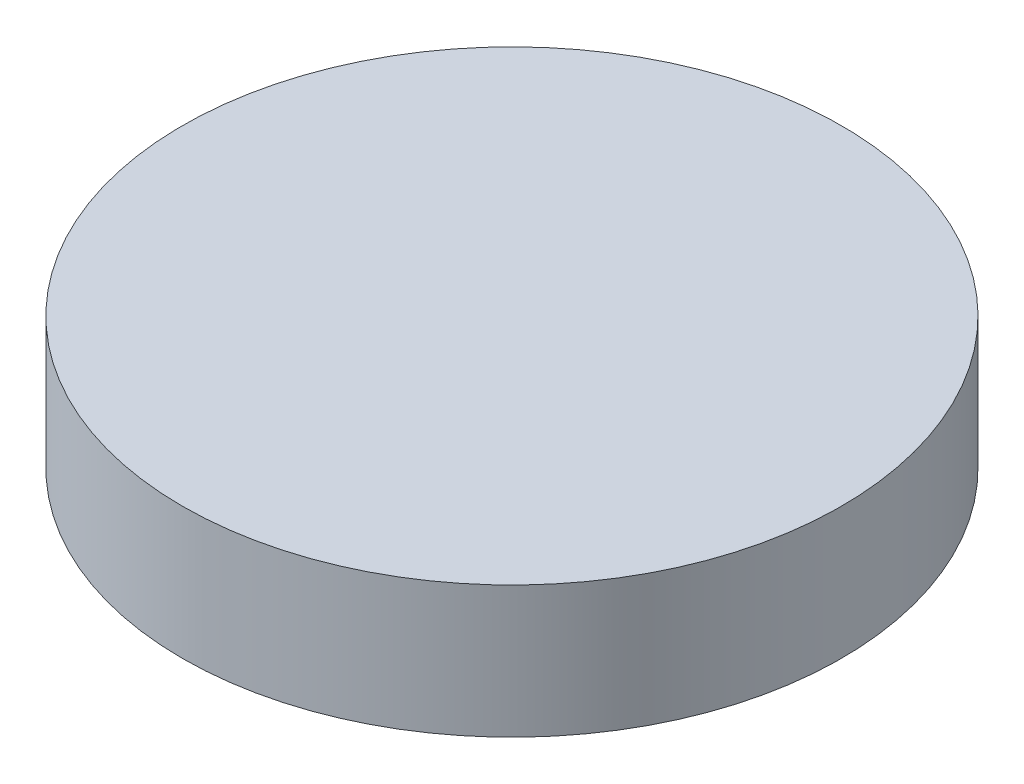
ISO-10303-21;
HEADER;
FILE_DESCRIPTION(('STEP AP214'),'2;1');
FILE_NAME('part.step','',(''),(''),'','','');
FILE_SCHEMA(('AUTOMOTIVE_DESIGN { 1 0 10303 214 1 1 1 1 }'));
ENDSEC;
DATA;
#1=APPLICATION_CONTEXT('core data for automotive mechanical design processes');
#2=APPLICATION_PROTOCOL_DEFINITION('international standard','automotive_design',2000,#1);
#3=PRODUCT_CONTEXT('',#1,'mechanical');
#4=PRODUCT('Part','Part','',(#3));
#5=PRODUCT_RELATED_PRODUCT_CATEGORY('part','',(#4));
#6=PRODUCT_DEFINITION_FORMATION('','',#4);
#7=PRODUCT_DEFINITION_CONTEXT('part definition',#1,'design');
#8=PRODUCT_DEFINITION('design','',#6,#7);
#9=PRODUCT_DEFINITION_SHAPE('','',#8);
#10=(LENGTH_UNIT() NAMED_UNIT(*) SI_UNIT(.MILLI.,.METRE.));
#11=(NAMED_UNIT(*) PLANE_ANGLE_UNIT() SI_UNIT($,.RADIAN.));
#12=(NAMED_UNIT(*) SI_UNIT($,.STERADIAN.) SOLID_ANGLE_UNIT());
#13=UNCERTAINTY_MEASURE_WITH_UNIT(LENGTH_MEASURE(1.E-05),#10,'distance_accuracy_value','');
#14=(GEOMETRIC_REPRESENTATION_CONTEXT(3) GLOBAL_UNCERTAINTY_ASSIGNED_CONTEXT((#13)) GLOBAL_UNIT_ASSIGNED_CONTEXT((#10,
#11,#12)) REPRESENTATION_CONTEXT('',''));
#15=CARTESIAN_POINT('',(0.,0.,0.));
#16=DIRECTION('',(0.,0.,1.));
#17=DIRECTION('',(1.,0.,0.));
#18=AXIS2_PLACEMENT_3D('',#15,#16,#17);
#19=CARTESIAN_POINT('',(0.,25.4,0.));
#20=DIRECTION('',(0.,-1.,0.));
#21=DIRECTION('',(0.,0.,-1.));
#22=AXIS2_PLACEMENT_3D('',#19,#20,#21);
#23=CYLINDRICAL_SURFACE('',#22,63.5);
#24=CARTESIAN_POINT('',(0.,25.4,0.));
#25=DIRECTION('',(0.,1.,0.));
#26=DIRECTION('',(0.,0.,1.));
#27=AXIS2_PLACEMENT_3D('',#24,#25,#26);
#28=CIRCLE('',#27,63.5);
#29=CARTESIAN_POINT('',(0.,25.4,63.5));
#30=VERTEX_POINT('',#29);
#31=EDGE_CURVE('E10',#30,#30,#28,.T.);
#32=ORIENTED_EDGE('',*,*,#31,.F.);
#33=EDGE_LOOP('',(#32));
#34=FACE_BOUND('',#33,.T.);
#35=CARTESIAN_POINT('',(0.,0.,0.));
#36=DIRECTION('',(0.,1.,0.));
#37=DIRECTION('',(0.,0.,1.));
#38=AXIS2_PLACEMENT_3D('',#35,#36,#37);
#39=CIRCLE('',#38,63.5);
#40=CARTESIAN_POINT('',(0.,0.,63.5));
#41=VERTEX_POINT('',#40);
#42=EDGE_CURVE('E38',#41,#41,#39,.T.);
#43=ORIENTED_EDGE('',*,*,#42,.T.);
#44=EDGE_LOOP('',(#43));
#45=FACE_BOUND('',#44,.T.);
#46=ADVANCED_FACE('F35',(#34,#45),#23,.T.);
#47=CARTESIAN_POINT('',(0.,25.4,0.));
#48=DIRECTION('',(0.,1.,0.));
#49=DIRECTION('',(0.,0.,1.));
#50=AXIS2_PLACEMENT_3D('',#47,#48,#49);
#51=PLANE('',#50);
#52=ORIENTED_EDGE('',*,*,#31,.T.);
#53=EDGE_LOOP('',(#52));
#54=FACE_BOUND('',#53,.T.);
#55=ADVANCED_FACE('F50',(#54),#51,.T.);
#56=CARTESIAN_POINT('',(0.,0.,0.));
#57=DIRECTION('',(0.,1.,0.));
#58=DIRECTION('',(0.,0.,1.));
#59=AXIS2_PLACEMENT_3D('',#56,#57,#58);
#60=PLANE('',#59);
#61=ORIENTED_EDGE('',*,*,#42,.F.);
#62=EDGE_LOOP('',(#61));
#63=FACE_BOUND('',#62,.T.);
#64=ADVANCED_FACE('F48',(#63),#60,.F.);
#65=CLOSED_SHELL('',(#46,#55,#64));
#66=MANIFOLD_SOLID_BREP('B2',#65);
#67=ADVANCED_BREP_SHAPE_REPRESENTATION('',(#18,#66),#14);
#68=SHAPE_DEFINITION_REPRESENTATION(#9,#67);
ENDSEC;
END-ISO-10303-21;
